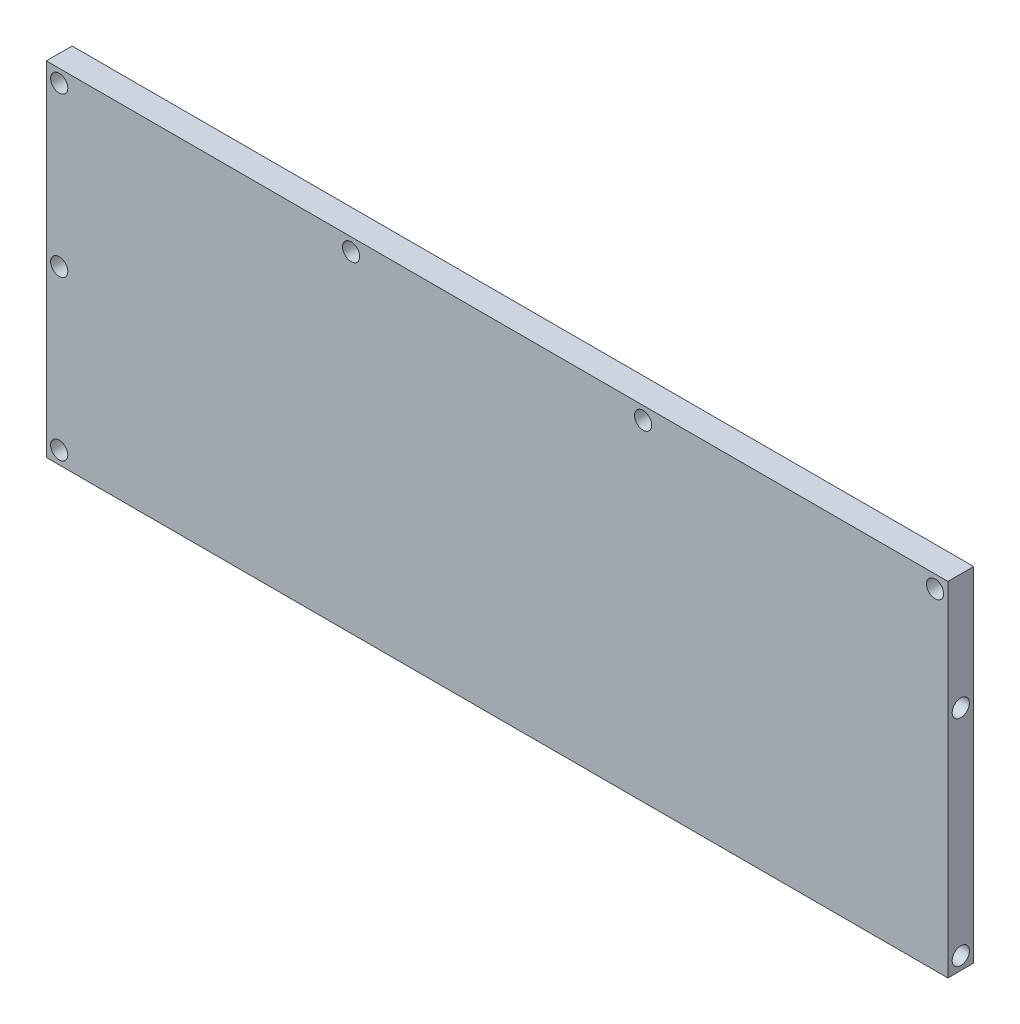
ISO-10303-21;
HEADER;
FILE_DESCRIPTION(('STEP AP214'),'2;1');
FILE_NAME('part.step','',(''),(''),'','','');
FILE_SCHEMA(('AUTOMOTIVE_DESIGN { 1 0 10303 214 1 1 1 1 }'));
ENDSEC;
DATA;
#1=APPLICATION_CONTEXT('core data for automotive mechanical design processes');
#2=APPLICATION_PROTOCOL_DEFINITION('international standard','automotive_design',2000,#1);
#3=PRODUCT_CONTEXT('',#1,'mechanical');
#4=PRODUCT('Part','Part','',(#3));
#5=PRODUCT_RELATED_PRODUCT_CATEGORY('part','',(#4));
#6=PRODUCT_DEFINITION_FORMATION('','',#4);
#7=PRODUCT_DEFINITION_CONTEXT('part definition',#1,'design');
#8=PRODUCT_DEFINITION('design','',#6,#7);
#9=PRODUCT_DEFINITION_SHAPE('','',#8);
#10=(LENGTH_UNIT() NAMED_UNIT(*) SI_UNIT(.MILLI.,.METRE.));
#11=(NAMED_UNIT(*) PLANE_ANGLE_UNIT() SI_UNIT($,.RADIAN.));
#12=(NAMED_UNIT(*) SI_UNIT($,.STERADIAN.) SOLID_ANGLE_UNIT());
#13=UNCERTAINTY_MEASURE_WITH_UNIT(LENGTH_MEASURE(1.E-05),#10,'distance_accuracy_value','');
#14=(GEOMETRIC_REPRESENTATION_CONTEXT(3) GLOBAL_UNCERTAINTY_ASSIGNED_CONTEXT((#13)) GLOBAL_UNIT_ASSIGNED_CONTEXT((#10,
#11,#12)) REPRESENTATION_CONTEXT('',''));
#15=CARTESIAN_POINT('',(0.,0.,0.));
#16=DIRECTION('',(0.,0.,1.));
#17=DIRECTION('',(1.,0.,0.));
#18=AXIS2_PLACEMENT_3D('',#15,#16,#17);
#19=CARTESIAN_POINT('',(-105.,-40.,6.));
#20=DIRECTION('',(1.,0.,0.));
#21=DIRECTION('',(0.,0.,-1.));
#22=AXIS2_PLACEMENT_3D('',#19,#20,#21);
#23=PLANE('',#22);
#24=DIRECTION('',(0.,-1.,0.));
#25=VECTOR('',#24,1.);
#26=CARTESIAN_POINT('',(-105.,-40.,0.));
#27=LINE('',#26,#25);
#28=CARTESIAN_POINT('',(-105.,40.,0.));
#29=VERTEX_POINT('',#28);
#30=CARTESIAN_POINT('',(-105.,-40.,0.));
#31=VERTEX_POINT('',#30);
#32=EDGE_CURVE('E98',#29,#31,#27,.T.);
#33=ORIENTED_EDGE('',*,*,#32,.T.);
#34=DIRECTION('',(0.,0.,-1.));
#35=VECTOR('',#34,1.);
#36=CARTESIAN_POINT('',(-105.,-40.,6.));
#37=LINE('',#36,#35);
#38=CARTESIAN_POINT('',(-105.,-40.,6.));
#39=VERTEX_POINT('',#38);
#40=EDGE_CURVE('E11',#39,#31,#37,.T.);
#41=ORIENTED_EDGE('',*,*,#40,.F.);
#42=DIRECTION('',(0.,-1.,0.));
#43=VECTOR('',#42,1.);
#44=CARTESIAN_POINT('',(-105.,-40.,6.));
#45=LINE('',#44,#43);
#46=CARTESIAN_POINT('',(-105.,40.,6.));
#47=VERTEX_POINT('',#46);
#48=EDGE_CURVE('E86',#47,#39,#45,.T.);
#49=ORIENTED_EDGE('',*,*,#48,.F.);
#50=DIRECTION('',(0.,0.,-1.));
#51=VECTOR('',#50,1.);
#52=CARTESIAN_POINT('',(-105.,40.,6.));
#53=LINE('',#52,#51);
#54=EDGE_CURVE('E94',#47,#29,#53,.T.);
#55=ORIENTED_EDGE('',*,*,#54,.T.);
#56=EDGE_LOOP('',(#33,#41,#49,#55));
#57=FACE_BOUND('',#56,.T.);
#58=ADVANCED_FACE('F35',(#57),#23,.F.);
#59=CARTESIAN_POINT('',(-105.,-40.,6.));
#60=DIRECTION('',(0.,1.,0.));
#61=DIRECTION('',(0.,0.,1.));
#62=AXIS2_PLACEMENT_3D('',#59,#60,#61);
#63=PLANE('',#62);
#64=DIRECTION('',(1.,0.,0.));
#65=VECTOR('',#64,1.);
#66=CARTESIAN_POINT('',(-105.,-40.,0.));
#67=LINE('',#66,#65);
#68=CARTESIAN_POINT('',(105.,-40.,0.));
#69=VERTEX_POINT('',#68);
#70=EDGE_CURVE('E90',#31,#69,#67,.T.);
#71=ORIENTED_EDGE('',*,*,#70,.T.);
#72=DIRECTION('',(0.,0.,-1.));
#73=VECTOR('',#72,1.);
#74=CARTESIAN_POINT('',(105.,-40.,6.));
#75=LINE('',#74,#73);
#76=CARTESIAN_POINT('',(105.,-40.,6.));
#77=VERTEX_POINT('',#76);
#78=EDGE_CURVE('E43',#77,#69,#75,.T.);
#79=ORIENTED_EDGE('',*,*,#78,.F.);
#80=DIRECTION('',(1.,0.,0.));
#81=VECTOR('',#80,1.);
#82=CARTESIAN_POINT('',(-105.,-40.,6.));
#83=LINE('',#82,#81);
#84=EDGE_CURVE('E81',#39,#77,#83,.T.);
#85=ORIENTED_EDGE('',*,*,#84,.F.);
#86=ORIENTED_EDGE('',*,*,#40,.T.);
#87=EDGE_LOOP('',(#71,#79,#85,#86));
#88=FACE_BOUND('',#87,.T.);
#89=ADVANCED_FACE('F89',(#88),#63,.F.);
#90=CARTESIAN_POINT('',(105.,-40.,6.));
#91=DIRECTION('',(-1.,0.,0.));
#92=DIRECTION('',(0.,-1.,0.));
#93=AXIS2_PLACEMENT_3D('',#90,#91,#92);
#94=PLANE('',#93);
#95=CARTESIAN_POINT('',(105.,13.,3.));
#96=DIRECTION('',(1.,0.,0.));
#97=DIRECTION('',(0.,1.,0.));
#98=AXIS2_PLACEMENT_3D('',#95,#96,#97);
#99=CIRCLE('',#98,2.);
#100=CARTESIAN_POINT('',(105.,15.,3.));
#101=VERTEX_POINT('',#100);
#102=EDGE_CURVE('E154',#101,#101,#99,.T.);
#103=ORIENTED_EDGE('',*,*,#102,.F.);
#104=EDGE_LOOP('',(#103));
#105=FACE_BOUND('',#104,.T.);
#106=CARTESIAN_POINT('',(105.,-37.,3.));
#107=DIRECTION('',(1.,0.,0.));
#108=DIRECTION('',(0.,1.,0.));
#109=AXIS2_PLACEMENT_3D('',#106,#107,#108);
#110=CIRCLE('',#109,2.);
#111=CARTESIAN_POINT('',(105.,-35.,3.));
#112=VERTEX_POINT('',#111);
#113=EDGE_CURVE('E148',#112,#112,#110,.T.);
#114=ORIENTED_EDGE('',*,*,#113,.F.);
#115=EDGE_LOOP('',(#114));
#116=FACE_BOUND('',#115,.T.);
#117=DIRECTION('',(0.,1.,0.));
#118=VECTOR('',#117,1.);
#119=CARTESIAN_POINT('',(105.,-40.,0.));
#120=LINE('',#119,#118);
#121=CARTESIAN_POINT('',(105.,40.,0.));
#122=VERTEX_POINT('',#121);
#123=EDGE_CURVE('E68',#69,#122,#120,.T.);
#124=ORIENTED_EDGE('',*,*,#123,.T.);
#125=DIRECTION('',(0.,0.,-1.));
#126=VECTOR('',#125,1.);
#127=CARTESIAN_POINT('',(105.,40.,6.));
#128=LINE('',#127,#126);
#129=CARTESIAN_POINT('',(105.,40.,6.));
#130=VERTEX_POINT('',#129);
#131=EDGE_CURVE('E91',#130,#122,#128,.T.);
#132=ORIENTED_EDGE('',*,*,#131,.F.);
#133=DIRECTION('',(0.,1.,0.));
#134=VECTOR('',#133,1.);
#135=CARTESIAN_POINT('',(105.,-40.,6.));
#136=LINE('',#135,#134);
#137=EDGE_CURVE('E84',#77,#130,#136,.T.);
#138=ORIENTED_EDGE('',*,*,#137,.F.);
#139=ORIENTED_EDGE('',*,*,#78,.T.);
#140=EDGE_LOOP('',(#124,#132,#138,#139));
#141=FACE_BOUND('',#140,.T.);
#142=ADVANCED_FACE('F92',(#105,#116,#141),#94,.F.);
#143=CARTESIAN_POINT('',(-105.,40.,6.));
#144=DIRECTION('',(0.,-1.,0.));
#145=DIRECTION('',(0.,0.,-1.));
#146=AXIS2_PLACEMENT_3D('',#143,#144,#145);
#147=PLANE('',#146);
#148=DIRECTION('',(-1.,0.,0.));
#149=VECTOR('',#148,1.);
#150=CARTESIAN_POINT('',(-105.,40.,0.));
#151=LINE('',#150,#149);
#152=EDGE_CURVE('E74',#122,#29,#151,.T.);
#153=ORIENTED_EDGE('',*,*,#152,.T.);
#154=ORIENTED_EDGE('',*,*,#54,.F.);
#155=DIRECTION('',(-1.,0.,0.));
#156=VECTOR('',#155,1.);
#157=CARTESIAN_POINT('',(-105.,40.,6.));
#158=LINE('',#157,#156);
#159=EDGE_CURVE('E51',#130,#47,#158,.T.);
#160=ORIENTED_EDGE('',*,*,#159,.F.);
#161=ORIENTED_EDGE('',*,*,#131,.T.);
#162=EDGE_LOOP('',(#153,#154,#160,#161));
#163=FACE_BOUND('',#162,.T.);
#164=ADVANCED_FACE('F106',(#163),#147,.F.);
#165=CARTESIAN_POINT('',(0.,0.,6.));
#166=DIRECTION('',(0.,0.,-1.));
#167=DIRECTION('',(-1.,0.,0.));
#168=AXIS2_PLACEMENT_3D('',#165,#166,#167);
#169=PLANE('',#168);
#170=CARTESIAN_POINT('',(102.,37.,6.));
#171=DIRECTION('',(0.,0.,1.));
#172=DIRECTION('',(1.,0.,0.));
#173=AXIS2_PLACEMENT_3D('',#170,#171,#172);
#174=CIRCLE('',#173,2.);
#175=CARTESIAN_POINT('',(104.,37.,6.));
#176=VERTEX_POINT('',#175);
#177=EDGE_CURVE('E142',#176,#176,#174,.T.);
#178=ORIENTED_EDGE('',*,*,#177,.F.);
#179=EDGE_LOOP('',(#178));
#180=FACE_BOUND('',#179,.T.);
#181=CARTESIAN_POINT('',(34.,37.,6.));
#182=DIRECTION('',(0.,0.,1.));
#183=DIRECTION('',(1.,0.,0.));
#184=AXIS2_PLACEMENT_3D('',#181,#182,#183);
#185=CIRCLE('',#184,2.);
#186=CARTESIAN_POINT('',(36.,37.,6.));
#187=VERTEX_POINT('',#186);
#188=EDGE_CURVE('E136',#187,#187,#185,.T.);
#189=ORIENTED_EDGE('',*,*,#188,.F.);
#190=EDGE_LOOP('',(#189));
#191=FACE_BOUND('',#190,.T.);
#192=CARTESIAN_POINT('',(-34.,37.,6.));
#193=DIRECTION('',(0.,0.,1.));
#194=DIRECTION('',(1.,0.,0.));
#195=AXIS2_PLACEMENT_3D('',#192,#193,#194);
#196=CIRCLE('',#195,2.);
#197=CARTESIAN_POINT('',(-32.,37.,6.));
#198=VERTEX_POINT('',#197);
#199=EDGE_CURVE('E130',#198,#198,#196,.T.);
#200=ORIENTED_EDGE('',*,*,#199,.F.);
#201=EDGE_LOOP('',(#200));
#202=FACE_BOUND('',#201,.T.);
#203=CARTESIAN_POINT('',(-102.,-37.,6.));
#204=DIRECTION('',(0.,0.,1.));
#205=DIRECTION('',(-1.,0.,0.));
#206=AXIS2_PLACEMENT_3D('',#203,#204,#205);
#207=CIRCLE('',#206,2.);
#208=CARTESIAN_POINT('',(-104.,-37.,6.));
#209=VERTEX_POINT('',#208);
#210=EDGE_CURVE('E124',#209,#209,#207,.T.);
#211=ORIENTED_EDGE('',*,*,#210,.F.);
#212=EDGE_LOOP('',(#211));
#213=FACE_BOUND('',#212,.T.);
#214=CARTESIAN_POINT('',(-102.,37.,6.));
#215=DIRECTION('',(0.,0.,1.));
#216=DIRECTION('',(1.,0.,0.));
#217=AXIS2_PLACEMENT_3D('',#214,#215,#216);
#218=CIRCLE('',#217,2.);
#219=CARTESIAN_POINT('',(-100.,37.,6.));
#220=VERTEX_POINT('',#219);
#221=EDGE_CURVE('E118',#220,#220,#218,.T.);
#222=ORIENTED_EDGE('',*,*,#221,.F.);
#223=EDGE_LOOP('',(#222));
#224=FACE_BOUND('',#223,.T.);
#225=CARTESIAN_POINT('',(-102.,0.,6.));
#226=DIRECTION('',(0.,0.,1.));
#227=DIRECTION('',(1.,0.,0.));
#228=AXIS2_PLACEMENT_3D('',#225,#226,#227);
#229=CIRCLE('',#228,2.);
#230=CARTESIAN_POINT('',(-100.,0.,6.));
#231=VERTEX_POINT('',#230);
#232=EDGE_CURVE('E112',#231,#231,#229,.T.);
#233=ORIENTED_EDGE('',*,*,#232,.F.);
#234=EDGE_LOOP('',(#233));
#235=FACE_BOUND('',#234,.T.);
#236=ORIENTED_EDGE('',*,*,#48,.T.);
#237=ORIENTED_EDGE('',*,*,#84,.T.);
#238=ORIENTED_EDGE('',*,*,#137,.T.);
#239=ORIENTED_EDGE('',*,*,#159,.T.);
#240=EDGE_LOOP('',(#236,#237,#238,#239));
#241=FACE_BOUND('',#240,.T.);
#242=ADVANCED_FACE('F82',(#180,#191,#202,#213,#224,#235,#241),#169,.F.);
#243=CARTESIAN_POINT('',(0.,0.,0.));
#244=DIRECTION('',(0.,0.,-1.));
#245=DIRECTION('',(-1.,0.,0.));
#246=AXIS2_PLACEMENT_3D('',#243,#244,#245);
#247=PLANE('',#246);
#248=CARTESIAN_POINT('',(102.,37.,0.));
#249=DIRECTION('',(0.,0.,1.));
#250=DIRECTION('',(1.,0.,0.));
#251=AXIS2_PLACEMENT_3D('',#248,#249,#250);
#252=CIRCLE('',#251,2.);
#253=CARTESIAN_POINT('',(104.,37.,0.));
#254=VERTEX_POINT('',#253);
#255=EDGE_CURVE('E139',#254,#254,#252,.T.);
#256=ORIENTED_EDGE('',*,*,#255,.T.);
#257=EDGE_LOOP('',(#256));
#258=FACE_BOUND('',#257,.T.);
#259=CARTESIAN_POINT('',(34.,37.,0.));
#260=DIRECTION('',(0.,0.,1.));
#261=DIRECTION('',(1.,0.,0.));
#262=AXIS2_PLACEMENT_3D('',#259,#260,#261);
#263=CIRCLE('',#262,2.);
#264=CARTESIAN_POINT('',(36.,37.,0.));
#265=VERTEX_POINT('',#264);
#266=EDGE_CURVE('E133',#265,#265,#263,.T.);
#267=ORIENTED_EDGE('',*,*,#266,.T.);
#268=EDGE_LOOP('',(#267));
#269=FACE_BOUND('',#268,.T.);
#270=CARTESIAN_POINT('',(-34.,37.,0.));
#271=DIRECTION('',(0.,0.,1.));
#272=DIRECTION('',(1.,0.,0.));
#273=AXIS2_PLACEMENT_3D('',#270,#271,#272);
#274=CIRCLE('',#273,2.);
#275=CARTESIAN_POINT('',(-32.,37.,0.));
#276=VERTEX_POINT('',#275);
#277=EDGE_CURVE('E127',#276,#276,#274,.T.);
#278=ORIENTED_EDGE('',*,*,#277,.T.);
#279=EDGE_LOOP('',(#278));
#280=FACE_BOUND('',#279,.T.);
#281=CARTESIAN_POINT('',(-102.,-37.,0.));
#282=DIRECTION('',(0.,0.,1.));
#283=DIRECTION('',(-1.,0.,0.));
#284=AXIS2_PLACEMENT_3D('',#281,#282,#283);
#285=CIRCLE('',#284,2.);
#286=CARTESIAN_POINT('',(-104.,-37.,0.));
#287=VERTEX_POINT('',#286);
#288=EDGE_CURVE('E121',#287,#287,#285,.T.);
#289=ORIENTED_EDGE('',*,*,#288,.T.);
#290=EDGE_LOOP('',(#289));
#291=FACE_BOUND('',#290,.T.);
#292=CARTESIAN_POINT('',(-102.,37.,0.));
#293=DIRECTION('',(0.,0.,1.));
#294=DIRECTION('',(1.,0.,0.));
#295=AXIS2_PLACEMENT_3D('',#292,#293,#294);
#296=CIRCLE('',#295,2.);
#297=CARTESIAN_POINT('',(-100.,37.,0.));
#298=VERTEX_POINT('',#297);
#299=EDGE_CURVE('E115',#298,#298,#296,.T.);
#300=ORIENTED_EDGE('',*,*,#299,.T.);
#301=EDGE_LOOP('',(#300));
#302=FACE_BOUND('',#301,.T.);
#303=CARTESIAN_POINT('',(-102.,0.,0.));
#304=DIRECTION('',(0.,0.,1.));
#305=DIRECTION('',(1.,0.,0.));
#306=AXIS2_PLACEMENT_3D('',#303,#304,#305);
#307=CIRCLE('',#306,2.);
#308=CARTESIAN_POINT('',(-100.,0.,0.));
#309=VERTEX_POINT('',#308);
#310=EDGE_CURVE('E101',#309,#309,#307,.T.);
#311=ORIENTED_EDGE('',*,*,#310,.T.);
#312=EDGE_LOOP('',(#311));
#313=FACE_BOUND('',#312,.T.);
#314=ORIENTED_EDGE('',*,*,#32,.F.);
#315=ORIENTED_EDGE('',*,*,#152,.F.);
#316=ORIENTED_EDGE('',*,*,#123,.F.);
#317=ORIENTED_EDGE('',*,*,#70,.F.);
#318=EDGE_LOOP('',(#314,#315,#316,#317));
#319=FACE_BOUND('',#318,.T.);
#320=ADVANCED_FACE('F109',(#258,#269,#280,#291,#302,#313,#319),#247,.T.);
#321=CARTESIAN_POINT('',(-102.,0.,0.));
#322=DIRECTION('',(0.,0.,1.));
#323=DIRECTION('',(1.,0.,0.));
#324=AXIS2_PLACEMENT_3D('',#321,#322,#323);
#325=CYLINDRICAL_SURFACE('',#324,2.);
#326=ORIENTED_EDGE('',*,*,#310,.F.);
#327=EDGE_LOOP('',(#326));
#328=FACE_BOUND('',#327,.T.);
#329=ORIENTED_EDGE('',*,*,#232,.T.);
#330=EDGE_LOOP('',(#329));
#331=FACE_BOUND('',#330,.T.);
#332=ADVANCED_FACE('F200',(#328,#331),#325,.F.);
#333=CARTESIAN_POINT('',(-102.,37.,0.));
#334=DIRECTION('',(0.,0.,1.));
#335=DIRECTION('',(1.,0.,0.));
#336=AXIS2_PLACEMENT_3D('',#333,#334,#335);
#337=CYLINDRICAL_SURFACE('',#336,2.);
#338=ORIENTED_EDGE('',*,*,#299,.F.);
#339=EDGE_LOOP('',(#338));
#340=FACE_BOUND('',#339,.T.);
#341=ORIENTED_EDGE('',*,*,#221,.T.);
#342=EDGE_LOOP('',(#341));
#343=FACE_BOUND('',#342,.T.);
#344=ADVANCED_FACE('F207',(#340,#343),#337,.F.);
#345=CARTESIAN_POINT('',(-102.,-37.,0.));
#346=DIRECTION('',(0.,0.,1.));
#347=DIRECTION('',(1.,0.,0.));
#348=AXIS2_PLACEMENT_3D('',#345,#346,#347);
#349=CYLINDRICAL_SURFACE('',#348,2.);
#350=ORIENTED_EDGE('',*,*,#288,.F.);
#351=EDGE_LOOP('',(#350));
#352=FACE_BOUND('',#351,.T.);
#353=ORIENTED_EDGE('',*,*,#210,.T.);
#354=EDGE_LOOP('',(#353));
#355=FACE_BOUND('',#354,.T.);
#356=ADVANCED_FACE('F211',(#352,#355),#349,.F.);
#357=CARTESIAN_POINT('',(-34.,37.,0.));
#358=DIRECTION('',(0.,0.,1.));
#359=DIRECTION('',(1.,0.,0.));
#360=AXIS2_PLACEMENT_3D('',#357,#358,#359);
#361=CYLINDRICAL_SURFACE('',#360,2.);
#362=ORIENTED_EDGE('',*,*,#277,.F.);
#363=EDGE_LOOP('',(#362));
#364=FACE_BOUND('',#363,.T.);
#365=ORIENTED_EDGE('',*,*,#199,.T.);
#366=EDGE_LOOP('',(#365));
#367=FACE_BOUND('',#366,.T.);
#368=ADVANCED_FACE('F215',(#364,#367),#361,.F.);
#369=CARTESIAN_POINT('',(34.,37.,0.));
#370=DIRECTION('',(0.,0.,1.));
#371=DIRECTION('',(1.,0.,0.));
#372=AXIS2_PLACEMENT_3D('',#369,#370,#371);
#373=CYLINDRICAL_SURFACE('',#372,2.);
#374=ORIENTED_EDGE('',*,*,#266,.F.);
#375=EDGE_LOOP('',(#374));
#376=FACE_BOUND('',#375,.T.);
#377=ORIENTED_EDGE('',*,*,#188,.T.);
#378=EDGE_LOOP('',(#377));
#379=FACE_BOUND('',#378,.T.);
#380=ADVANCED_FACE('F185',(#376,#379),#373,.F.);
#381=CARTESIAN_POINT('',(102.,37.,0.));
#382=DIRECTION('',(0.,0.,1.));
#383=DIRECTION('',(1.,0.,0.));
#384=AXIS2_PLACEMENT_3D('',#381,#382,#383);
#385=CYLINDRICAL_SURFACE('',#384,2.);
#386=ORIENTED_EDGE('',*,*,#255,.F.);
#387=EDGE_LOOP('',(#386));
#388=FACE_BOUND('',#387,.T.);
#389=ORIENTED_EDGE('',*,*,#177,.T.);
#390=EDGE_LOOP('',(#389));
#391=FACE_BOUND('',#390,.T.);
#392=ADVANCED_FACE('F176',(#388,#391),#385,.F.);
#393=CARTESIAN_POINT('',(85.,-37.,3.));
#394=DIRECTION('',(1.,0.,0.));
#395=DIRECTION('',(0.,1.,0.));
#396=AXIS2_PLACEMENT_3D('',#393,#394,#395);
#397=CYLINDRICAL_SURFACE('',#396,2.);
#398=CARTESIAN_POINT('',(85.,-37.,3.));
#399=DIRECTION('',(1.,0.,0.));
#400=DIRECTION('',(0.,1.,0.));
#401=AXIS2_PLACEMENT_3D('',#398,#399,#400);
#402=CIRCLE('',#401,2.);
#403=CARTESIAN_POINT('',(85.,-35.,3.));
#404=VERTEX_POINT('',#403);
#405=EDGE_CURVE('E145',#404,#404,#402,.T.);
#406=ORIENTED_EDGE('',*,*,#405,.F.);
#407=EDGE_LOOP('',(#406));
#408=FACE_BOUND('',#407,.T.);
#409=ORIENTED_EDGE('',*,*,#113,.T.);
#410=EDGE_LOOP('',(#409));
#411=FACE_BOUND('',#410,.T.);
#412=ADVANCED_FACE('F174',(#408,#411),#397,.F.);
#413=CARTESIAN_POINT('',(85.,-37.,3.));
#414=DIRECTION('',(1.,0.,0.));
#415=DIRECTION('',(0.,1.,0.));
#416=AXIS2_PLACEMENT_3D('',#413,#414,#415);
#417=PLANE('',#416);
#418=ORIENTED_EDGE('',*,*,#405,.T.);
#419=EDGE_LOOP('',(#418));
#420=FACE_BOUND('',#419,.T.);
#421=ADVANCED_FACE('F165',(#420),#417,.T.);
#422=CARTESIAN_POINT('',(85.,13.,3.));
#423=DIRECTION('',(1.,0.,0.));
#424=DIRECTION('',(0.,1.,0.));
#425=AXIS2_PLACEMENT_3D('',#422,#423,#424);
#426=CYLINDRICAL_SURFACE('',#425,2.);
#427=CARTESIAN_POINT('',(85.,13.,3.));
#428=DIRECTION('',(1.,0.,0.));
#429=DIRECTION('',(0.,1.,0.));
#430=AXIS2_PLACEMENT_3D('',#427,#428,#429);
#431=CIRCLE('',#430,2.);
#432=CARTESIAN_POINT('',(85.,15.,3.));
#433=VERTEX_POINT('',#432);
#434=EDGE_CURVE('E151',#433,#433,#431,.T.);
#435=ORIENTED_EDGE('',*,*,#434,.F.);
#436=EDGE_LOOP('',(#435));
#437=FACE_BOUND('',#436,.T.);
#438=ORIENTED_EDGE('',*,*,#102,.T.);
#439=EDGE_LOOP('',(#438));
#440=FACE_BOUND('',#439,.T.);
#441=ADVANCED_FACE('F162',(#437,#440),#426,.F.);
#442=CARTESIAN_POINT('',(85.,13.,3.));
#443=DIRECTION('',(1.,0.,0.));
#444=DIRECTION('',(0.,1.,0.));
#445=AXIS2_PLACEMENT_3D('',#442,#443,#444);
#446=PLANE('',#445);
#447=ORIENTED_EDGE('',*,*,#434,.T.);
#448=EDGE_LOOP('',(#447));
#449=FACE_BOUND('',#448,.T.);
#450=ADVANCED_FACE('F160',(#449),#446,.T.);
#451=CLOSED_SHELL('',(#58,#89,#142,#164,#242,#320,#332,#344,#356,#368,#380,#392,#412,#421,#441,#450));
#452=MANIFOLD_SOLID_BREP('B2',#451);
#453=ADVANCED_BREP_SHAPE_REPRESENTATION('',(#18,#452),#14);
#454=SHAPE_DEFINITION_REPRESENTATION(#9,#453);
ENDSEC;
END-ISO-10303-21;
